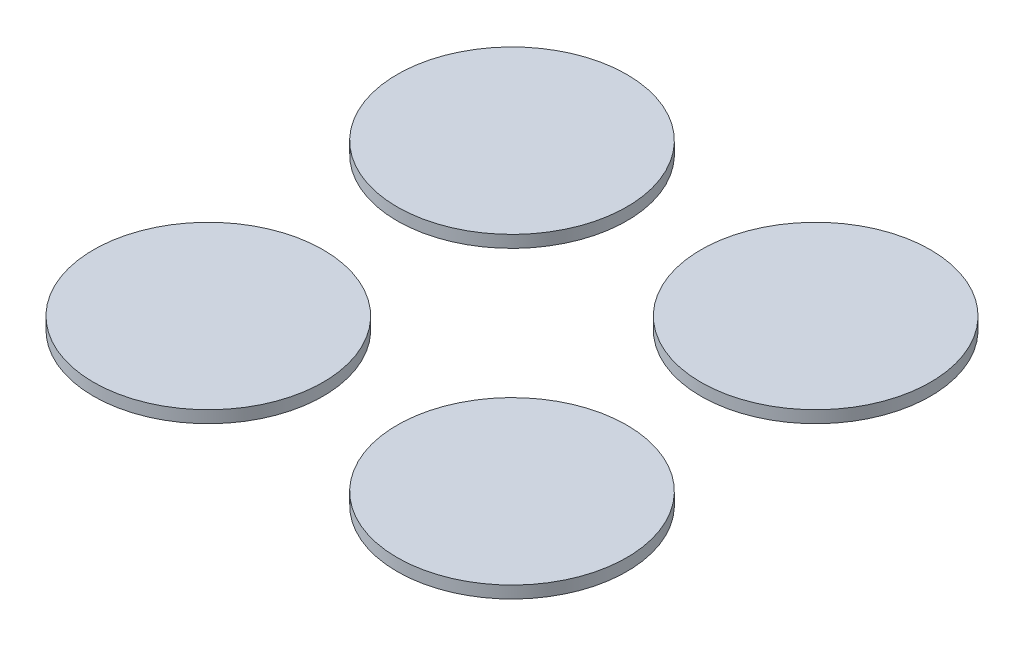
ISO-10303-21;
HEADER;
FILE_DESCRIPTION(('STEP AP214'),'2;1');
FILE_NAME('part.step','',(''),(''),'','','');
FILE_SCHEMA(('AUTOMOTIVE_DESIGN { 1 0 10303 214 1 1 1 1 }'));
ENDSEC;
DATA;
#1=APPLICATION_CONTEXT('core data for automotive mechanical design processes');
#2=APPLICATION_PROTOCOL_DEFINITION('international standard','automotive_design',2000,#1);
#3=PRODUCT_CONTEXT('',#1,'mechanical');
#4=PRODUCT('Part','Part','',(#3));
#5=PRODUCT_RELATED_PRODUCT_CATEGORY('part','',(#4));
#6=PRODUCT_DEFINITION_FORMATION('','',#4);
#7=PRODUCT_DEFINITION_CONTEXT('part definition',#1,'design');
#8=PRODUCT_DEFINITION('design','',#6,#7);
#9=PRODUCT_DEFINITION_SHAPE('','',#8);
#10=(LENGTH_UNIT() NAMED_UNIT(*) SI_UNIT(.MILLI.,.METRE.));
#11=(NAMED_UNIT(*) PLANE_ANGLE_UNIT() SI_UNIT($,.RADIAN.));
#12=(NAMED_UNIT(*) SI_UNIT($,.STERADIAN.) SOLID_ANGLE_UNIT());
#13=UNCERTAINTY_MEASURE_WITH_UNIT(LENGTH_MEASURE(1.E-05),#10,'distance_accuracy_value','');
#14=(GEOMETRIC_REPRESENTATION_CONTEXT(3) GLOBAL_UNCERTAINTY_ASSIGNED_CONTEXT((#13)) GLOBAL_UNIT_ASSIGNED_CONTEXT((#10,
#11,#12)) REPRESENTATION_CONTEXT('',''));
#15=CARTESIAN_POINT('',(0.,0.,0.));
#16=DIRECTION('',(0.,0.,1.));
#17=DIRECTION('',(1.,0.,0.));
#18=AXIS2_PLACEMENT_3D('',#15,#16,#17);
#19=CARTESIAN_POINT('',(-30.4449999999984,2.43,30.445));
#20=DIRECTION('',(0.,-1.,0.));
#21=DIRECTION('',(0.,0.,-1.));
#22=AXIS2_PLACEMENT_3D('',#19,#20,#21);
#23=CYLINDRICAL_SURFACE('',#22,23.0200000000009);
#24=CARTESIAN_POINT('',(-30.4449999999984,2.43,30.445));
#25=DIRECTION('',(0.,1.,0.));
#26=DIRECTION('',(0.,0.,1.));
#27=AXIS2_PLACEMENT_3D('',#24,#25,#26);
#28=CIRCLE('',#27,23.0200000000009);
#29=CARTESIAN_POINT('',(-30.4449999999984,2.43,53.4650000000009));
#30=VERTEX_POINT('',#29);
#31=EDGE_CURVE('E11',#30,#30,#28,.T.);
#32=ORIENTED_EDGE('',*,*,#31,.F.);
#33=EDGE_LOOP('',(#32));
#34=FACE_BOUND('',#33,.T.);
#35=CARTESIAN_POINT('',(-30.4449999999984,0.,30.445));
#36=DIRECTION('',(0.,1.,0.));
#37=DIRECTION('',(0.,0.,1.));
#38=AXIS2_PLACEMENT_3D('',#35,#36,#37);
#39=CIRCLE('',#38,23.0200000000009);
#40=CARTESIAN_POINT('',(-30.4449999999984,0.,53.4650000000009));
#41=VERTEX_POINT('',#40);
#42=EDGE_CURVE('E49',#41,#41,#39,.T.);
#43=ORIENTED_EDGE('',*,*,#42,.T.);
#44=EDGE_LOOP('',(#43));
#45=FACE_BOUND('',#44,.T.);
#46=ADVANCED_FACE('F46',(#34,#45),#23,.T.);
#47=CARTESIAN_POINT('',(-30.4449999999984,2.43,30.445));
#48=DIRECTION('',(0.,1.,0.));
#49=DIRECTION('',(0.,0.,1.));
#50=AXIS2_PLACEMENT_3D('',#47,#48,#49);
#51=PLANE('',#50);
#52=ORIENTED_EDGE('',*,*,#31,.T.);
#53=EDGE_LOOP('',(#52));
#54=FACE_BOUND('',#53,.T.);
#55=ADVANCED_FACE('F61',(#54),#51,.T.);
#56=CARTESIAN_POINT('',(-30.4449999999984,0.,30.445));
#57=DIRECTION('',(0.,1.,0.));
#58=DIRECTION('',(0.,0.,1.));
#59=AXIS2_PLACEMENT_3D('',#56,#57,#58);
#60=PLANE('',#59);
#61=ORIENTED_EDGE('',*,*,#42,.F.);
#62=EDGE_LOOP('',(#61));
#63=FACE_BOUND('',#62,.T.);
#64=ADVANCED_FACE('F59',(#63),#60,.F.);
#65=CLOSED_SHELL('',(#46,#55,#64));
#66=MANIFOLD_SOLID_BREP('B2',#65);
#67=CARTESIAN_POINT('',(30.4450000000017,2.43,30.4449999999984));
#68=DIRECTION('',(0.,-1.,0.));
#69=DIRECTION('',(0.,0.,-1.));
#70=AXIS2_PLACEMENT_3D('',#67,#68,#69);
#71=CYLINDRICAL_SURFACE('',#70,23.0200000000024);
#72=CARTESIAN_POINT('',(30.4450000000017,2.43,30.4449999999984));
#73=DIRECTION('',(0.,1.,0.));
#74=DIRECTION('',(0.,0.,1.));
#75=AXIS2_PLACEMENT_3D('',#72,#73,#74);
#76=CIRCLE('',#75,23.0200000000024);
#77=CARTESIAN_POINT('',(30.4450000000017,2.43,53.4650000000008));
#78=VERTEX_POINT('',#77);
#79=EDGE_CURVE('E45',#78,#78,#76,.T.);
#80=ORIENTED_EDGE('',*,*,#79,.F.);
#81=EDGE_LOOP('',(#80));
#82=FACE_BOUND('',#81,.T.);
#83=CARTESIAN_POINT('',(30.4450000000017,0.,30.4449999999984));
#84=DIRECTION('',(0.,1.,0.));
#85=DIRECTION('',(0.,0.,1.));
#86=AXIS2_PLACEMENT_3D('',#83,#84,#85);
#87=CIRCLE('',#86,23.0200000000024);
#88=CARTESIAN_POINT('',(30.4450000000017,0.,53.4650000000008));
#89=VERTEX_POINT('',#88);
#90=EDGE_CURVE('E98',#89,#89,#87,.T.);
#91=ORIENTED_EDGE('',*,*,#90,.T.);
#92=EDGE_LOOP('',(#91));
#93=FACE_BOUND('',#92,.T.);
#94=ADVANCED_FACE('F95',(#82,#93),#71,.T.);
#95=CARTESIAN_POINT('',(30.4450000000017,2.43,30.4449999999984));
#96=DIRECTION('',(0.,1.,0.));
#97=DIRECTION('',(0.,0.,1.));
#98=AXIS2_PLACEMENT_3D('',#95,#96,#97);
#99=PLANE('',#98);
#100=ORIENTED_EDGE('',*,*,#79,.T.);
#101=EDGE_LOOP('',(#100));
#102=FACE_BOUND('',#101,.T.);
#103=ADVANCED_FACE('F110',(#102),#99,.T.);
#104=CARTESIAN_POINT('',(30.4450000000017,0.,30.4449999999984));
#105=DIRECTION('',(0.,1.,0.));
#106=DIRECTION('',(0.,0.,1.));
#107=AXIS2_PLACEMENT_3D('',#104,#105,#106);
#108=PLANE('',#107);
#109=ORIENTED_EDGE('',*,*,#90,.F.);
#110=EDGE_LOOP('',(#109));
#111=FACE_BOUND('',#110,.T.);
#112=ADVANCED_FACE('F108',(#111),#108,.F.);
#113=CLOSED_SHELL('',(#94,#103,#112));
#114=MANIFOLD_SOLID_BREP('B6',#113);
#115=CARTESIAN_POINT('',(30.4450000000002,2.43,-30.4450000000016));
#116=DIRECTION('',(0.,-1.,0.));
#117=DIRECTION('',(0.,0.,-1.));
#118=AXIS2_PLACEMENT_3D('',#115,#116,#117);
#119=CYLINDRICAL_SURFACE('',#118,23.0200000000018);
#120=CARTESIAN_POINT('',(30.4450000000002,2.43,-30.4450000000016));
#121=DIRECTION('',(0.,1.,0.));
#122=DIRECTION('',(0.,0.,1.));
#123=AXIS2_PLACEMENT_3D('',#120,#121,#122);
#124=CIRCLE('',#123,23.0200000000018);
#125=CARTESIAN_POINT('',(30.4450000000002,2.43,-7.42499999999989));
#126=VERTEX_POINT('',#125);
#127=EDGE_CURVE('E94',#126,#126,#124,.T.);
#128=ORIENTED_EDGE('',*,*,#127,.F.);
#129=EDGE_LOOP('',(#128));
#130=FACE_BOUND('',#129,.T.);
#131=CARTESIAN_POINT('',(30.4450000000002,0.,-30.4450000000016));
#132=DIRECTION('',(0.,1.,0.));
#133=DIRECTION('',(0.,0.,1.));
#134=AXIS2_PLACEMENT_3D('',#131,#132,#133);
#135=CIRCLE('',#134,23.0200000000018);
#136=CARTESIAN_POINT('',(30.4450000000002,0.,-7.42499999999989));
#137=VERTEX_POINT('',#136);
#138=EDGE_CURVE('E146',#137,#137,#135,.T.);
#139=ORIENTED_EDGE('',*,*,#138,.T.);
#140=EDGE_LOOP('',(#139));
#141=FACE_BOUND('',#140,.T.);
#142=ADVANCED_FACE('F143',(#130,#141),#119,.T.);
#143=CARTESIAN_POINT('',(30.4450000000002,2.43,-30.4450000000016));
#144=DIRECTION('',(0.,1.,0.));
#145=DIRECTION('',(0.,0.,1.));
#146=AXIS2_PLACEMENT_3D('',#143,#144,#145);
#147=PLANE('',#146);
#148=ORIENTED_EDGE('',*,*,#127,.T.);
#149=EDGE_LOOP('',(#148));
#150=FACE_BOUND('',#149,.T.);
#151=ADVANCED_FACE('F158',(#150),#147,.T.);
#152=CARTESIAN_POINT('',(30.4450000000002,0.,-30.4450000000016));
#153=DIRECTION('',(0.,1.,0.));
#154=DIRECTION('',(0.,0.,1.));
#155=AXIS2_PLACEMENT_3D('',#152,#153,#154);
#156=PLANE('',#155);
#157=ORIENTED_EDGE('',*,*,#138,.F.);
#158=EDGE_LOOP('',(#157));
#159=FACE_BOUND('',#158,.T.);
#160=ADVANCED_FACE('F156',(#159),#156,.F.);
#161=CLOSED_SHELL('',(#142,#151,#160));
#162=MANIFOLD_SOLID_BREP('B40',#161);
#163=CARTESIAN_POINT('',(-30.4449999999999,2.43,-30.4450000000001));
#164=DIRECTION('',(0.,-1.,0.));
#165=DIRECTION('',(0.,0.,-1.));
#166=AXIS2_PLACEMENT_3D('',#163,#164,#165);
#167=CYLINDRICAL_SURFACE('',#166,23.02);
#168=CARTESIAN_POINT('',(-30.4449999999999,2.43,-30.4450000000001));
#169=DIRECTION('',(0.,1.,0.));
#170=DIRECTION('',(0.,0.,1.));
#171=AXIS2_PLACEMENT_3D('',#168,#169,#170);
#172=CIRCLE('',#171,23.02);
#173=CARTESIAN_POINT('',(-30.4449999999999,2.43,-7.42500000000015));
#174=VERTEX_POINT('',#173);
#175=EDGE_CURVE('E142',#174,#174,#172,.T.);
#176=ORIENTED_EDGE('',*,*,#175,.F.);
#177=EDGE_LOOP('',(#176));
#178=FACE_BOUND('',#177,.T.);
#179=CARTESIAN_POINT('',(-30.4449999999999,0.,-30.4450000000001));
#180=DIRECTION('',(0.,1.,0.));
#181=DIRECTION('',(0.,0.,1.));
#182=AXIS2_PLACEMENT_3D('',#179,#180,#181);
#183=CIRCLE('',#182,23.02);
#184=CARTESIAN_POINT('',(-30.4449999999999,0.,-7.42500000000015));
#185=VERTEX_POINT('',#184);
#186=EDGE_CURVE('E187',#185,#185,#183,.T.);
#187=ORIENTED_EDGE('',*,*,#186,.T.);
#188=EDGE_LOOP('',(#187));
#189=FACE_BOUND('',#188,.T.);
#190=ADVANCED_FACE('F184',(#178,#189),#167,.T.);
#191=CARTESIAN_POINT('',(-30.4449999999999,2.43,-30.4450000000001));
#192=DIRECTION('',(0.,1.,0.));
#193=DIRECTION('',(0.,0.,1.));
#194=AXIS2_PLACEMENT_3D('',#191,#192,#193);
#195=PLANE('',#194);
#196=ORIENTED_EDGE('',*,*,#175,.T.);
#197=EDGE_LOOP('',(#196));
#198=FACE_BOUND('',#197,.T.);
#199=ADVANCED_FACE('F199',(#198),#195,.T.);
#200=CARTESIAN_POINT('',(-30.4449999999999,0.,-30.4450000000001));
#201=DIRECTION('',(0.,1.,0.));
#202=DIRECTION('',(0.,0.,1.));
#203=AXIS2_PLACEMENT_3D('',#200,#201,#202);
#204=PLANE('',#203);
#205=ORIENTED_EDGE('',*,*,#186,.F.);
#206=EDGE_LOOP('',(#205));
#207=FACE_BOUND('',#206,.T.);
#208=ADVANCED_FACE('F197',(#207),#204,.F.);
#209=CLOSED_SHELL('',(#190,#199,#208));
#210=MANIFOLD_SOLID_BREP('B89',#209);
#211=ADVANCED_BREP_SHAPE_REPRESENTATION('',(#18,#66,#114,#162,#210),#14);
#212=SHAPE_DEFINITION_REPRESENTATION(#9,#211);
ENDSEC;
END-ISO-10303-21;
